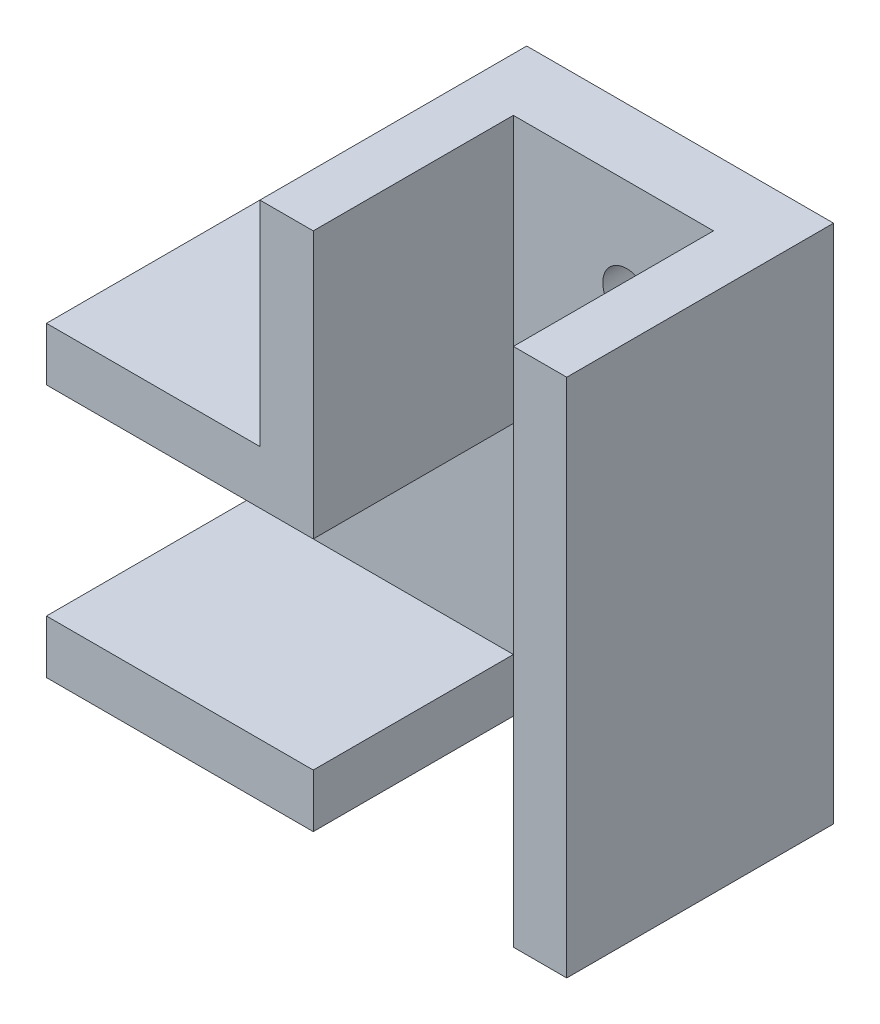
ISO-10303-21;
HEADER;
FILE_DESCRIPTION(('STEP AP214'),'2;1');
FILE_NAME('part.step','',(''),(''),'','','');
FILE_SCHEMA(('AUTOMOTIVE_DESIGN { 1 0 10303 214 1 1 1 1 }'));
ENDSEC;
DATA;
#1=APPLICATION_CONTEXT('core data for automotive mechanical design processes');
#2=APPLICATION_PROTOCOL_DEFINITION('international standard','automotive_design',2000,#1);
#3=PRODUCT_CONTEXT('',#1,'mechanical');
#4=PRODUCT('Part','Part','',(#3));
#5=PRODUCT_RELATED_PRODUCT_CATEGORY('part','',(#4));
#6=PRODUCT_DEFINITION_FORMATION('','',#4);
#7=PRODUCT_DEFINITION_CONTEXT('part definition',#1,'design');
#8=PRODUCT_DEFINITION('design','',#6,#7);
#9=PRODUCT_DEFINITION_SHAPE('','',#8);
#10=(LENGTH_UNIT() NAMED_UNIT(*) SI_UNIT(.MILLI.,.METRE.));
#11=(NAMED_UNIT(*) PLANE_ANGLE_UNIT() SI_UNIT($,.RADIAN.));
#12=(NAMED_UNIT(*) SI_UNIT($,.STERADIAN.) SOLID_ANGLE_UNIT());
#13=UNCERTAINTY_MEASURE_WITH_UNIT(LENGTH_MEASURE(1.E-05),#10,'distance_accuracy_value','');
#14=(GEOMETRIC_REPRESENTATION_CONTEXT(3) GLOBAL_UNCERTAINTY_ASSIGNED_CONTEXT((#13)) GLOBAL_UNIT_ASSIGNED_CONTEXT((#10,
#11,#12)) REPRESENTATION_CONTEXT('',''));
#15=CARTESIAN_POINT('',(0.,0.,0.));
#16=DIRECTION('',(0.,0.,1.));
#17=DIRECTION('',(1.,0.,0.));
#18=AXIS2_PLACEMENT_3D('',#15,#16,#17);
#19=CARTESIAN_POINT('',(0.,0.,20.));
#20=DIRECTION('',(0.,0.,-1.));
#21=DIRECTION('',(-1.,0.,0.));
#22=AXIS2_PLACEMENT_3D('',#19,#20,#21);
#23=PLANE('',#22);
#24=DIRECTION('',(-1.,0.,0.));
#25=VECTOR('',#24,1.);
#26=CARTESIAN_POINT('',(14.3137254901961,-23.2647058823529,20.));
#27=LINE('',#26,#25);
#28=CARTESIAN_POINT('',(-0.686274509803913,-23.2647058823529,20.));
#29=VERTEX_POINT('',#28);
#30=CARTESIAN_POINT('',(-20.6862745098039,-23.2647058823529,20.));
#31=VERTEX_POINT('',#30);
#32=EDGE_CURVE('E152',#29,#31,#27,.T.);
#33=ORIENTED_EDGE('',*,*,#32,.F.);
#34=DIRECTION('',(0.,1.,0.));
#35=VECTOR('',#34,1.);
#36=CARTESIAN_POINT('',(-0.686274509803913,-23.2647058823529,20.));
#37=LINE('',#36,#35);
#38=CARTESIAN_POINT('',(-0.686274509803913,-19.2647058823529,20.));
#39=VERTEX_POINT('',#38);
#40=EDGE_CURVE('E135',#29,#39,#37,.T.);
#41=ORIENTED_EDGE('',*,*,#40,.T.);
#42=DIRECTION('',(1.,0.,0.));
#43=VECTOR('',#42,1.);
#44=CARTESIAN_POINT('',(-20.6862745098039,-19.2647058823529,20.));
#45=LINE('',#44,#43);
#46=CARTESIAN_POINT('',(-20.6862745098039,-19.2647058823529,20.));
#47=VERTEX_POINT('',#46);
#48=EDGE_CURVE('E162',#47,#39,#45,.T.);
#49=ORIENTED_EDGE('',*,*,#48,.F.);
#50=DIRECTION('',(0.,1.,0.));
#51=VECTOR('',#50,1.);
#52=CARTESIAN_POINT('',(-20.6862745098039,-23.2647058823529,20.));
#53=LINE('',#52,#51);
#54=EDGE_CURVE('E160',#31,#47,#53,.T.);
#55=ORIENTED_EDGE('',*,*,#54,.F.);
#56=EDGE_LOOP('',(#33,#41,#49,#55));
#57=FACE_BOUND('',#56,.T.);
#58=ADVANCED_FACE('F33',(#57),#23,.F.);
#59=CARTESIAN_POINT('',(-20.6862745098039,-4.26470588235294,5.));
#60=DIRECTION('',(1.,0.,0.));
#61=DIRECTION('',(0.,1.,0.));
#62=AXIS2_PLACEMENT_3D('',#59,#60,#61);
#63=PLANE('',#62);
#64=DIRECTION('',(0.,-1.,0.));
#65=VECTOR('',#64,1.);
#66=CARTESIAN_POINT('',(-20.6862745098039,-4.26470588235294,0.));
#67=LINE('',#66,#65);
#68=CARTESIAN_POINT('',(-20.6862745098039,-0.264705882352941,0.));
#69=VERTEX_POINT('',#68);
#70=CARTESIAN_POINT('',(-20.6862745098039,-23.2647058823529,0.));
#71=VERTEX_POINT('',#70);
#72=EDGE_CURVE('E202',#69,#71,#67,.T.);
#73=ORIENTED_EDGE('',*,*,#72,.T.);
#74=DIRECTION('',(0.,0.,-1.));
#75=VECTOR('',#74,1.);
#76=CARTESIAN_POINT('',(-20.6862745098039,-23.2647058823529,20.));
#77=LINE('',#76,#75);
#78=EDGE_CURVE('E173',#31,#71,#77,.T.);
#79=ORIENTED_EDGE('',*,*,#78,.F.);
#80=ORIENTED_EDGE('',*,*,#54,.T.);
#81=DIRECTION('',(0.,0.,-1.));
#82=VECTOR('',#81,1.);
#83=CARTESIAN_POINT('',(-20.6862745098039,-19.2647058823529,20.));
#84=LINE('',#83,#82);
#85=CARTESIAN_POINT('',(-20.6862745098039,-19.2647058823529,5.));
#86=VERTEX_POINT('',#85);
#87=EDGE_CURVE('E165',#47,#86,#84,.T.);
#88=ORIENTED_EDGE('',*,*,#87,.T.);
#89=DIRECTION('',(0.,-1.,0.));
#90=VECTOR('',#89,1.);
#91=CARTESIAN_POINT('',(-20.6862745098039,-4.26470588235294,5.));
#92=LINE('',#91,#90);
#93=CARTESIAN_POINT('',(-20.6862745098039,-4.26470588235294,5.));
#94=VERTEX_POINT('',#93);
#95=EDGE_CURVE('E216',#94,#86,#92,.T.);
#96=ORIENTED_EDGE('',*,*,#95,.F.);
#97=DIRECTION('',(0.,0.,-1.));
#98=VECTOR('',#97,1.);
#99=CARTESIAN_POINT('',(-20.6862745098039,-4.26470588235294,20.));
#100=LINE('',#99,#98);
#101=CARTESIAN_POINT('',(-20.6862745098039,-4.26470588235294,20.));
#102=VERTEX_POINT('',#101);
#103=EDGE_CURVE('E199',#102,#94,#100,.T.);
#104=ORIENTED_EDGE('',*,*,#103,.F.);
#105=DIRECTION('',(0.,1.,0.));
#106=VECTOR('',#105,1.);
#107=CARTESIAN_POINT('',(-20.6862745098039,-4.26470588235294,20.));
#108=LINE('',#107,#106);
#109=CARTESIAN_POINT('',(-20.6862745098039,-0.264705882352941,20.));
#110=VERTEX_POINT('',#109);
#111=EDGE_CURVE('E178',#102,#110,#108,.T.);
#112=ORIENTED_EDGE('',*,*,#111,.T.);
#113=DIRECTION('',(0.,0.,-1.));
#114=VECTOR('',#113,1.);
#115=CARTESIAN_POINT('',(-20.6862745098039,-0.264705882352941,20.));
#116=LINE('',#115,#114);
#117=EDGE_CURVE('E194',#110,#69,#116,.T.);
#118=ORIENTED_EDGE('',*,*,#117,.T.);
#119=EDGE_LOOP('',(#73,#79,#80,#88,#96,#104,#112,#118));
#120=FACE_BOUND('',#119,.T.);
#121=ADVANCED_FACE('F35',(#120),#63,.F.);
#122=CARTESIAN_POINT('',(-0.686274509803913,15.7352941176471,5.));
#123=DIRECTION('',(0.,-1.,0.));
#124=DIRECTION('',(0.,0.,-1.));
#125=AXIS2_PLACEMENT_3D('',#122,#123,#124);
#126=PLANE('',#125);
#127=DIRECTION('',(-1.,0.,0.));
#128=VECTOR('',#127,1.);
#129=CARTESIAN_POINT('',(-0.686274509803913,15.7352941176471,0.));
#130=LINE('',#129,#128);
#131=CARTESIAN_POINT('',(18.3137254901961,15.7352941176471,0.));
#132=VERTEX_POINT('',#131);
#133=CARTESIAN_POINT('',(-4.68627450980391,15.7352941176471,0.));
#134=VERTEX_POINT('',#133);
#135=EDGE_CURVE('E37',#132,#134,#130,.T.);
#136=ORIENTED_EDGE('',*,*,#135,.T.);
#137=DIRECTION('',(0.,0.,-1.));
#138=VECTOR('',#137,1.);
#139=CARTESIAN_POINT('',(-4.68627450980391,15.7352941176471,20.));
#140=LINE('',#139,#138);
#141=CARTESIAN_POINT('',(-4.68627450980391,15.7352941176471,20.));
#142=VERTEX_POINT('',#141);
#143=EDGE_CURVE('E209',#142,#134,#140,.T.);
#144=ORIENTED_EDGE('',*,*,#143,.F.);
#145=DIRECTION('',(-1.,0.,0.));
#146=VECTOR('',#145,1.);
#147=CARTESIAN_POINT('',(-0.686274509803913,15.7352941176471,20.));
#148=LINE('',#147,#146);
#149=CARTESIAN_POINT('',(-0.686274509803913,15.7352941176471,20.));
#150=VERTEX_POINT('',#149);
#151=EDGE_CURVE('E187',#150,#142,#148,.T.);
#152=ORIENTED_EDGE('',*,*,#151,.F.);
#153=DIRECTION('',(0.,0.,-1.));
#154=VECTOR('',#153,1.);
#155=CARTESIAN_POINT('',(-0.686274509803913,15.7352941176471,20.));
#156=LINE('',#155,#154);
#157=CARTESIAN_POINT('',(-0.686274509803913,15.7352941176471,5.));
#158=VERTEX_POINT('',#157);
#159=EDGE_CURVE('E206',#150,#158,#156,.T.);
#160=ORIENTED_EDGE('',*,*,#159,.T.);
#161=DIRECTION('',(-1.,0.,0.));
#162=VECTOR('',#161,1.);
#163=CARTESIAN_POINT('',(-0.686274509803913,15.7352941176471,5.));
#164=LINE('',#163,#162);
#165=CARTESIAN_POINT('',(14.3137254901961,15.7352941176471,5.));
#166=VERTEX_POINT('',#165);
#167=EDGE_CURVE('E224',#166,#158,#164,.T.);
#168=ORIENTED_EDGE('',*,*,#167,.F.);
#169=DIRECTION('',(0.,0.,-1.));
#170=VECTOR('',#169,1.);
#171=CARTESIAN_POINT('',(14.3137254901961,15.7352941176471,20.));
#172=LINE('',#171,#170);
#173=CARTESIAN_POINT('',(14.3137254901961,15.7352941176471,20.));
#174=VERTEX_POINT('',#173);
#175=EDGE_CURVE('E404',#174,#166,#172,.T.);
#176=ORIENTED_EDGE('',*,*,#175,.F.);
#177=DIRECTION('',(1.,0.,0.));
#178=VECTOR('',#177,1.);
#179=CARTESIAN_POINT('',(14.3137254901961,15.7352941176471,20.));
#180=LINE('',#179,#178);
#181=CARTESIAN_POINT('',(18.3137254901961,15.7352941176471,20.));
#182=VERTEX_POINT('',#181);
#183=EDGE_CURVE('E396',#174,#182,#180,.T.);
#184=ORIENTED_EDGE('',*,*,#183,.T.);
#185=DIRECTION('',(0.,0.,-1.));
#186=VECTOR('',#185,1.);
#187=CARTESIAN_POINT('',(18.3137254901961,15.7352941176471,20.));
#188=LINE('',#187,#186);
#189=EDGE_CURVE('E234',#182,#132,#188,.T.);
#190=ORIENTED_EDGE('',*,*,#189,.T.);
#191=EDGE_LOOP('',(#136,#144,#152,#160,#168,#176,#184,#190));
#192=FACE_BOUND('',#191,.T.);
#193=ADVANCED_FACE('F230',(#192),#126,.F.);
#194=CARTESIAN_POINT('',(0.,0.,5.));
#195=DIRECTION('',(0.,0.,1.));
#196=DIRECTION('',(1.,0.,0.));
#197=AXIS2_PLACEMENT_3D('',#194,#195,#196);
#198=PLANE('',#197);
#199=DIRECTION('',(1.,0.,0.));
#200=VECTOR('',#199,1.);
#201=CARTESIAN_POINT('',(-20.6862745098039,-19.2647058823529,5.));
#202=LINE('',#201,#200);
#203=CARTESIAN_POINT('',(-0.686274509803913,-19.2647058823529,5.));
#204=VERTEX_POINT('',#203);
#205=EDGE_CURVE('E218',#86,#204,#202,.T.);
#206=ORIENTED_EDGE('',*,*,#205,.T.);
#207=DIRECTION('',(0.,1.,0.));
#208=VECTOR('',#207,1.);
#209=CARTESIAN_POINT('',(-0.686274509803913,-23.2647058823529,5.));
#210=LINE('',#209,#208);
#211=CARTESIAN_POINT('',(-0.686274509803913,-23.2647058823529,5.));
#212=VERTEX_POINT('',#211);
#213=EDGE_CURVE('E146',#212,#204,#210,.T.);
#214=ORIENTED_EDGE('',*,*,#213,.F.);
#215=DIRECTION('',(-1.,0.,0.));
#216=VECTOR('',#215,1.);
#217=CARTESIAN_POINT('',(-0.686274509803913,-23.2647058823529,5.));
#218=LINE('',#217,#216);
#219=CARTESIAN_POINT('',(14.3137254901961,-23.2647058823529,5.));
#220=VERTEX_POINT('',#219);
#221=EDGE_CURVE('E147',#220,#212,#218,.T.);
#222=ORIENTED_EDGE('',*,*,#221,.F.);
#223=DIRECTION('',(0.,1.,0.));
#224=VECTOR('',#223,1.);
#225=CARTESIAN_POINT('',(14.3137254901961,-4.26470588235294,5.));
#226=LINE('',#225,#224);
#227=EDGE_CURVE('E221',#220,#166,#226,.T.);
#228=ORIENTED_EDGE('',*,*,#227,.T.);
#229=ORIENTED_EDGE('',*,*,#167,.T.);
#230=DIRECTION('',(0.,-1.,0.));
#231=VECTOR('',#230,1.);
#232=CARTESIAN_POINT('',(-0.686274509803913,15.7352941176471,5.));
#233=LINE('',#232,#231);
#234=CARTESIAN_POINT('',(-0.68627450980391,-4.26470588235294,5.));
#235=VERTEX_POINT('',#234);
#236=EDGE_CURVE('E42',#158,#235,#233,.T.);
#237=ORIENTED_EDGE('',*,*,#236,.T.);
#238=DIRECTION('',(-1.,0.,0.));
#239=VECTOR('',#238,1.);
#240=CARTESIAN_POINT('',(-20.6862745098039,-4.26470588235294,5.));
#241=LINE('',#240,#239);
#242=EDGE_CURVE('E11',#235,#94,#241,.T.);
#243=ORIENTED_EDGE('',*,*,#242,.T.);
#244=ORIENTED_EDGE('',*,*,#95,.T.);
#245=EDGE_LOOP('',(#206,#214,#222,#228,#229,#237,#243,#244));
#246=FACE_BOUND('',#245,.T.);
#247=CARTESIAN_POINT('',(-13.1862745098039,-11.7647058823529,5.));
#248=DIRECTION('',(0.,0.,1.));
#249=DIRECTION('',(1.,0.,0.));
#250=AXIS2_PLACEMENT_3D('',#247,#248,#249);
#251=CIRCLE('',#250,1.8);
#252=CARTESIAN_POINT('',(-11.3862745098039,-11.7647058823529,5.));
#253=VERTEX_POINT('',#252);
#254=EDGE_CURVE('E386',#253,#253,#251,.T.);
#255=ORIENTED_EDGE('',*,*,#254,.F.);
#256=EDGE_LOOP('',(#255));
#257=FACE_BOUND('',#256,.T.);
#258=CARTESIAN_POINT('',(7.81372549019609,8.23529411764706,5.));
#259=DIRECTION('',(0.,0.,1.));
#260=DIRECTION('',(1.,0.,0.));
#261=AXIS2_PLACEMENT_3D('',#258,#259,#260);
#262=CIRCLE('',#261,1.8);
#263=CARTESIAN_POINT('',(9.61372549019609,8.23529411764706,5.));
#264=VERTEX_POINT('',#263);
#265=EDGE_CURVE('E380',#264,#264,#262,.T.);
#266=ORIENTED_EDGE('',*,*,#265,.F.);
#267=EDGE_LOOP('',(#266));
#268=FACE_BOUND('',#267,.T.);
#269=ADVANCED_FACE('F258',(#246,#257,#268),#198,.T.);
#270=CARTESIAN_POINT('',(0.,0.,0.));
#271=DIRECTION('',(0.,0.,1.));
#272=DIRECTION('',(1.,0.,0.));
#273=AXIS2_PLACEMENT_3D('',#270,#271,#272);
#274=PLANE('',#273);
#275=CARTESIAN_POINT('',(7.81372549019609,8.23529411764706,0.));
#276=DIRECTION('',(0.,0.,1.));
#277=DIRECTION('',(1.,0.,0.));
#278=AXIS2_PLACEMENT_3D('',#275,#276,#277);
#279=CIRCLE('',#278,1.8);
#280=CARTESIAN_POINT('',(9.61372549019609,8.23529411764706,0.));
#281=VERTEX_POINT('',#280);
#282=EDGE_CURVE('E172',#281,#281,#279,.T.);
#283=ORIENTED_EDGE('',*,*,#282,.T.);
#284=EDGE_LOOP('',(#283));
#285=FACE_BOUND('',#284,.T.);
#286=CARTESIAN_POINT('',(-13.1862745098039,-11.7647058823529,0.));
#287=DIRECTION('',(0.,0.,1.));
#288=DIRECTION('',(1.,0.,0.));
#289=AXIS2_PLACEMENT_3D('',#286,#287,#288);
#290=CIRCLE('',#289,1.8);
#291=CARTESIAN_POINT('',(-11.3862745098039,-11.7647058823529,0.));
#292=VERTEX_POINT('',#291);
#293=EDGE_CURVE('E382',#292,#292,#290,.T.);
#294=ORIENTED_EDGE('',*,*,#293,.T.);
#295=EDGE_LOOP('',(#294));
#296=FACE_BOUND('',#295,.T.);
#297=ORIENTED_EDGE('',*,*,#72,.F.);
#298=DIRECTION('',(1.,0.,0.));
#299=VECTOR('',#298,1.);
#300=CARTESIAN_POINT('',(-6.07997052750672,-0.264705882352943,0.));
#301=LINE('',#300,#299);
#302=CARTESIAN_POINT('',(-4.68627450980391,-0.264705882352945,0.));
#303=VERTEX_POINT('',#302);
#304=EDGE_CURVE('E175',#69,#303,#301,.T.);
#305=ORIENTED_EDGE('',*,*,#304,.T.);
#306=DIRECTION('',(0.,-1.,0.));
#307=VECTOR('',#306,1.);
#308=CARTESIAN_POINT('',(-4.68627450980391,15.7352941176471,0.));
#309=LINE('',#308,#307);
#310=EDGE_CURVE('E182',#134,#303,#309,.T.);
#311=ORIENTED_EDGE('',*,*,#310,.F.);
#312=ORIENTED_EDGE('',*,*,#135,.F.);
#313=DIRECTION('',(0.,-1.,0.));
#314=VECTOR('',#313,1.);
#315=CARTESIAN_POINT('',(18.3137254901961,15.7352941176471,0.));
#316=LINE('',#315,#314);
#317=CARTESIAN_POINT('',(18.3137254901961,-23.2647058823529,0.));
#318=VERTEX_POINT('',#317);
#319=EDGE_CURVE('E394',#132,#318,#316,.T.);
#320=ORIENTED_EDGE('',*,*,#319,.T.);
#321=DIRECTION('',(-1.,0.,0.));
#322=VECTOR('',#321,1.);
#323=CARTESIAN_POINT('',(14.3137254901961,-23.2647058823529,0.));
#324=LINE('',#323,#322);
#325=EDGE_CURVE('E169',#318,#71,#324,.T.);
#326=ORIENTED_EDGE('',*,*,#325,.T.);
#327=EDGE_LOOP('',(#297,#305,#311,#312,#320,#326));
#328=FACE_BOUND('',#327,.T.);
#329=ADVANCED_FACE('F242',(#285,#296,#328),#274,.F.);
#330=CARTESIAN_POINT('',(-20.6862745098039,-4.26470588235294,20.));
#331=DIRECTION('',(0.,1.,0.));
#332=DIRECTION('',(-1.,0.,0.));
#333=AXIS2_PLACEMENT_3D('',#330,#331,#332);
#334=PLANE('',#333);
#335=ORIENTED_EDGE('',*,*,#242,.F.);
#336=DIRECTION('',(0.,0.,-1.));
#337=VECTOR('',#336,1.);
#338=CARTESIAN_POINT('',(-0.686274509803916,-4.26470588235294,20.));
#339=LINE('',#338,#337);
#340=CARTESIAN_POINT('',(-0.686274509803916,-4.26470588235294,20.));
#341=VERTEX_POINT('',#340);
#342=EDGE_CURVE('E203',#341,#235,#339,.T.);
#343=ORIENTED_EDGE('',*,*,#342,.F.);
#344=DIRECTION('',(1.,0.,0.));
#345=VECTOR('',#344,1.);
#346=CARTESIAN_POINT('',(-20.6862745098039,-4.26470588235294,20.));
#347=LINE('',#346,#345);
#348=EDGE_CURVE('E192',#102,#341,#347,.T.);
#349=ORIENTED_EDGE('',*,*,#348,.F.);
#350=ORIENTED_EDGE('',*,*,#103,.T.);
#351=EDGE_LOOP('',(#335,#343,#349,#350));
#352=FACE_BOUND('',#351,.T.);
#353=ADVANCED_FACE('F261',(#352),#334,.F.);
#354=CARTESIAN_POINT('',(-0.686274509803913,15.7352941176471,20.));
#355=DIRECTION('',(1.,0.,0.));
#356=DIRECTION('',(0.,1.,0.));
#357=AXIS2_PLACEMENT_3D('',#354,#355,#356);
#358=PLANE('',#357);
#359=ORIENTED_EDGE('',*,*,#342,.T.);
#360=ORIENTED_EDGE('',*,*,#236,.F.);
#361=ORIENTED_EDGE('',*,*,#159,.F.);
#362=DIRECTION('',(0.,-1.,0.));
#363=VECTOR('',#362,1.);
#364=CARTESIAN_POINT('',(-0.686274509803913,15.7352941176471,20.));
#365=LINE('',#364,#363);
#366=EDGE_CURVE('E189',#150,#341,#365,.T.);
#367=ORIENTED_EDGE('',*,*,#366,.T.);
#368=EDGE_LOOP('',(#359,#360,#361,#367));
#369=FACE_BOUND('',#368,.T.);
#370=ADVANCED_FACE('F257',(#369),#358,.T.);
#371=CARTESIAN_POINT('',(-4.68627450980391,15.7352941176471,20.));
#372=DIRECTION('',(1.,0.,0.));
#373=DIRECTION('',(0.,1.,0.));
#374=AXIS2_PLACEMENT_3D('',#371,#372,#373);
#375=PLANE('',#374);
#376=ORIENTED_EDGE('',*,*,#310,.T.);
#377=DIRECTION('',(0.,0.,-1.));
#378=VECTOR('',#377,1.);
#379=CARTESIAN_POINT('',(-4.68627450980391,-0.264705882352945,20.));
#380=LINE('',#379,#378);
#381=CARTESIAN_POINT('',(-4.68627450980391,-0.264705882352945,20.));
#382=VERTEX_POINT('',#381);
#383=EDGE_CURVE('E212',#382,#303,#380,.T.);
#384=ORIENTED_EDGE('',*,*,#383,.F.);
#385=DIRECTION('',(0.,-1.,0.));
#386=VECTOR('',#385,1.);
#387=CARTESIAN_POINT('',(-4.68627450980391,15.7352941176471,20.));
#388=LINE('',#387,#386);
#389=EDGE_CURVE('E184',#142,#382,#388,.T.);
#390=ORIENTED_EDGE('',*,*,#389,.F.);
#391=ORIENTED_EDGE('',*,*,#143,.T.);
#392=EDGE_LOOP('',(#376,#384,#390,#391));
#393=FACE_BOUND('',#392,.T.);
#394=ADVANCED_FACE('F240',(#393),#375,.F.);
#395=CARTESIAN_POINT('',(-6.07997052750672,-0.264705882352943,20.));
#396=DIRECTION('',(0.,1.,0.));
#397=DIRECTION('',(-1.,0.,0.));
#398=AXIS2_PLACEMENT_3D('',#395,#396,#397);
#399=PLANE('',#398);
#400=ORIENTED_EDGE('',*,*,#304,.F.);
#401=ORIENTED_EDGE('',*,*,#117,.F.);
#402=DIRECTION('',(1.,0.,0.));
#403=VECTOR('',#402,1.);
#404=CARTESIAN_POINT('',(-20.6862745098039,-0.264705882352941,20.));
#405=LINE('',#404,#403);
#406=EDGE_CURVE('E181',#110,#382,#405,.T.);
#407=ORIENTED_EDGE('',*,*,#406,.T.);
#408=ORIENTED_EDGE('',*,*,#383,.T.);
#409=EDGE_LOOP('',(#400,#401,#407,#408));
#410=FACE_BOUND('',#409,.T.);
#411=ADVANCED_FACE('F245',(#410),#399,.T.);
#412=CARTESIAN_POINT('',(0.,0.,20.));
#413=DIRECTION('',(0.,0.,-1.));
#414=DIRECTION('',(-1.,0.,0.));
#415=AXIS2_PLACEMENT_3D('',#412,#413,#414);
#416=PLANE('',#415);
#417=ORIENTED_EDGE('',*,*,#111,.F.);
#418=ORIENTED_EDGE('',*,*,#348,.T.);
#419=ORIENTED_EDGE('',*,*,#366,.F.);
#420=ORIENTED_EDGE('',*,*,#151,.T.);
#421=ORIENTED_EDGE('',*,*,#389,.T.);
#422=ORIENTED_EDGE('',*,*,#406,.F.);
#423=EDGE_LOOP('',(#417,#418,#419,#420,#421,#422));
#424=FACE_BOUND('',#423,.T.);
#425=ADVANCED_FACE('F250',(#424),#416,.F.);
#426=CARTESIAN_POINT('',(-20.6862745098039,-19.2647058823529,20.));
#427=DIRECTION('',(0.,1.,0.));
#428=DIRECTION('',(0.,0.,1.));
#429=AXIS2_PLACEMENT_3D('',#426,#427,#428);
#430=PLANE('',#429);
#431=DIRECTION('',(0.,0.,1.));
#432=VECTOR('',#431,1.);
#433=CARTESIAN_POINT('',(-0.686274509803911,-19.2647058823529,20.));
#434=LINE('',#433,#432);
#435=EDGE_CURVE('E141',#204,#39,#434,.T.);
#436=ORIENTED_EDGE('',*,*,#435,.F.);
#437=ORIENTED_EDGE('',*,*,#205,.F.);
#438=ORIENTED_EDGE('',*,*,#87,.F.);
#439=ORIENTED_EDGE('',*,*,#48,.T.);
#440=EDGE_LOOP('',(#436,#437,#438,#439));
#441=FACE_BOUND('',#440,.T.);
#442=ADVANCED_FACE('F288',(#441),#430,.T.);
#443=CARTESIAN_POINT('',(14.3137254901961,-23.2647058823529,20.));
#444=DIRECTION('',(0.,-1.,0.));
#445=DIRECTION('',(0.,0.,-1.));
#446=AXIS2_PLACEMENT_3D('',#443,#444,#445);
#447=PLANE('',#446);
#448=DIRECTION('',(0.,0.,1.));
#449=VECTOR('',#448,1.);
#450=CARTESIAN_POINT('',(-0.686274509803913,-23.2647058823529,5.));
#451=LINE('',#450,#449);
#452=EDGE_CURVE('E138',#212,#29,#451,.T.);
#453=ORIENTED_EDGE('',*,*,#452,.T.);
#454=ORIENTED_EDGE('',*,*,#32,.T.);
#455=ORIENTED_EDGE('',*,*,#78,.T.);
#456=ORIENTED_EDGE('',*,*,#325,.F.);
#457=DIRECTION('',(0.,0.,-1.));
#458=VECTOR('',#457,1.);
#459=CARTESIAN_POINT('',(18.3137254901961,-23.2647058823529,20.));
#460=LINE('',#459,#458);
#461=CARTESIAN_POINT('',(18.3137254901961,-23.2647058823529,20.));
#462=VERTEX_POINT('',#461);
#463=EDGE_CURVE('E391',#462,#318,#460,.T.);
#464=ORIENTED_EDGE('',*,*,#463,.F.);
#465=CARTESIAN_POINT('',(14.3137254901961,-23.2647058823529,20.));
#466=VERTEX_POINT('',#465);
#467=EDGE_CURVE('E161',#462,#466,#27,.T.);
#468=ORIENTED_EDGE('',*,*,#467,.T.);
#469=DIRECTION('',(0.,0.,-1.));
#470=VECTOR('',#469,1.);
#471=CARTESIAN_POINT('',(14.3137254901961,-23.2647058823529,5.));
#472=LINE('',#471,#470);
#473=EDGE_CURVE('E156',#466,#220,#472,.T.);
#474=ORIENTED_EDGE('',*,*,#473,.T.);
#475=ORIENTED_EDGE('',*,*,#221,.T.);
#476=EDGE_LOOP('',(#453,#454,#455,#456,#464,#468,#474,#475));
#477=FACE_BOUND('',#476,.T.);
#478=ADVANCED_FACE('F150',(#477),#447,.T.);
#479=DIRECTION('',(0.,1.,0.));
#480=VECTOR('',#479,1.);
#481=CARTESIAN_POINT('',(14.3137254901961,15.7352941176471,20.));
#482=LINE('',#481,#480);
#483=EDGE_CURVE('E50',#466,#174,#482,.T.);
#484=ORIENTED_EDGE('',*,*,#483,.F.);
#485=ORIENTED_EDGE('',*,*,#467,.F.);
#486=DIRECTION('',(0.,-1.,0.));
#487=VECTOR('',#486,1.);
#488=CARTESIAN_POINT('',(18.3137254901961,15.7352941176471,20.));
#489=LINE('',#488,#487);
#490=EDGE_CURVE('E401',#182,#462,#489,.T.);
#491=ORIENTED_EDGE('',*,*,#490,.F.);
#492=ORIENTED_EDGE('',*,*,#183,.F.);
#493=EDGE_LOOP('',(#484,#485,#491,#492));
#494=FACE_BOUND('',#493,.T.);
#495=ADVANCED_FACE('F274',(#494),#23,.F.);
#496=CARTESIAN_POINT('',(-13.1862745098039,-11.7647058823529,0.));
#497=DIRECTION('',(0.,0.,1.));
#498=DIRECTION('',(1.,0.,0.));
#499=AXIS2_PLACEMENT_3D('',#496,#497,#498);
#500=CYLINDRICAL_SURFACE('',#499,1.8);
#501=ORIENTED_EDGE('',*,*,#293,.F.);
#502=EDGE_LOOP('',(#501));
#503=FACE_BOUND('',#502,.T.);
#504=ORIENTED_EDGE('',*,*,#254,.T.);
#505=EDGE_LOOP('',(#504));
#506=FACE_BOUND('',#505,.T.);
#507=ADVANCED_FACE('F281',(#503,#506),#500,.F.);
#508=CARTESIAN_POINT('',(7.81372549019609,8.23529411764706,0.));
#509=DIRECTION('',(0.,0.,1.));
#510=DIRECTION('',(1.,0.,0.));
#511=AXIS2_PLACEMENT_3D('',#508,#509,#510);
#512=CYLINDRICAL_SURFACE('',#511,1.8);
#513=ORIENTED_EDGE('',*,*,#282,.F.);
#514=EDGE_LOOP('',(#513));
#515=FACE_BOUND('',#514,.T.);
#516=ORIENTED_EDGE('',*,*,#265,.T.);
#517=EDGE_LOOP('',(#516));
#518=FACE_BOUND('',#517,.T.);
#519=ADVANCED_FACE('F286',(#515,#518),#512,.F.);
#520=CARTESIAN_POINT('',(14.3137254901961,15.7352941176471,20.));
#521=DIRECTION('',(-1.,0.,0.));
#522=DIRECTION('',(0.,-1.,0.));
#523=AXIS2_PLACEMENT_3D('',#520,#521,#522);
#524=PLANE('',#523);
#525=ORIENTED_EDGE('',*,*,#227,.F.);
#526=ORIENTED_EDGE('',*,*,#473,.F.);
#527=ORIENTED_EDGE('',*,*,#483,.T.);
#528=ORIENTED_EDGE('',*,*,#175,.T.);
#529=EDGE_LOOP('',(#525,#526,#527,#528));
#530=FACE_BOUND('',#529,.T.);
#531=ADVANCED_FACE('F331',(#530),#524,.T.);
#532=CARTESIAN_POINT('',(18.3137254901961,15.7352941176471,20.));
#533=DIRECTION('',(1.,0.,0.));
#534=DIRECTION('',(0.,1.,0.));
#535=AXIS2_PLACEMENT_3D('',#532,#533,#534);
#536=PLANE('',#535);
#537=ORIENTED_EDGE('',*,*,#319,.F.);
#538=ORIENTED_EDGE('',*,*,#189,.F.);
#539=ORIENTED_EDGE('',*,*,#490,.T.);
#540=ORIENTED_EDGE('',*,*,#463,.T.);
#541=EDGE_LOOP('',(#537,#538,#539,#540));
#542=FACE_BOUND('',#541,.T.);
#543=ADVANCED_FACE('F327',(#542),#536,.T.);
#544=CARTESIAN_POINT('',(-0.686274509803913,-23.2647058823529,5.));
#545=DIRECTION('',(-1.,0.,0.));
#546=DIRECTION('',(0.,0.,1.));
#547=AXIS2_PLACEMENT_3D('',#544,#545,#546);
#548=PLANE('',#547);
#549=ORIENTED_EDGE('',*,*,#435,.T.);
#550=ORIENTED_EDGE('',*,*,#40,.F.);
#551=ORIENTED_EDGE('',*,*,#452,.F.);
#552=ORIENTED_EDGE('',*,*,#213,.T.);
#553=EDGE_LOOP('',(#549,#550,#551,#552));
#554=FACE_BOUND('',#553,.T.);
#555=ADVANCED_FACE('F137',(#554),#548,.F.);
#556=CLOSED_SHELL('',(#58,#121,#193,#269,#329,#353,#370,#394,#411,#425,#442,#478,#495,#507,#519,
#531,#543,#555));
#557=MANIFOLD_SOLID_BREP('B2',#556);
#558=ADVANCED_BREP_SHAPE_REPRESENTATION('',(#18,#557),#14);
#559=SHAPE_DEFINITION_REPRESENTATION(#9,#558);
ENDSEC;
END-ISO-10303-21;
